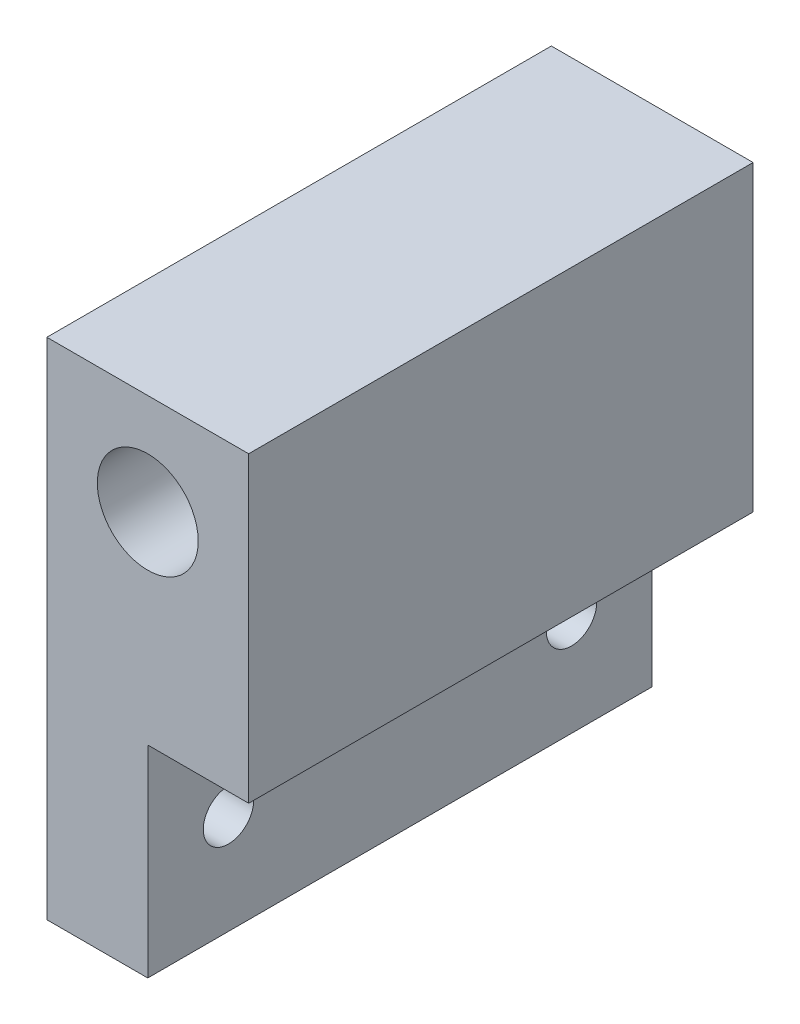
ISO-10303-21;
HEADER;
FILE_DESCRIPTION(('STEP AP214'),'2;1');
FILE_NAME('part.step','',(''),(''),'','','');
FILE_SCHEMA(('AUTOMOTIVE_DESIGN { 1 0 10303 214 1 1 1 1 }'));
ENDSEC;
DATA;
#1=APPLICATION_CONTEXT('core data for automotive mechanical design processes');
#2=APPLICATION_PROTOCOL_DEFINITION('international standard','automotive_design',2000,#1);
#3=PRODUCT_CONTEXT('',#1,'mechanical');
#4=PRODUCT('Part','Part','',(#3));
#5=PRODUCT_RELATED_PRODUCT_CATEGORY('part','',(#4));
#6=PRODUCT_DEFINITION_FORMATION('','',#4);
#7=PRODUCT_DEFINITION_CONTEXT('part definition',#1,'design');
#8=PRODUCT_DEFINITION('design','',#6,#7);
#9=PRODUCT_DEFINITION_SHAPE('','',#8);
#10=(LENGTH_UNIT() NAMED_UNIT(*) SI_UNIT(.MILLI.,.METRE.));
#11=(NAMED_UNIT(*) PLANE_ANGLE_UNIT() SI_UNIT($,.RADIAN.));
#12=(NAMED_UNIT(*) SI_UNIT($,.STERADIAN.) SOLID_ANGLE_UNIT());
#13=UNCERTAINTY_MEASURE_WITH_UNIT(LENGTH_MEASURE(1.E-05),#10,'distance_accuracy_value','');
#14=(GEOMETRIC_REPRESENTATION_CONTEXT(3) GLOBAL_UNCERTAINTY_ASSIGNED_CONTEXT((#13)) GLOBAL_UNIT_ASSIGNED_CONTEXT((#10,
#11,#12)) REPRESENTATION_CONTEXT('',''));
#15=CARTESIAN_POINT('',(0.,0.,0.));
#16=DIRECTION('',(0.,0.,1.));
#17=DIRECTION('',(1.,0.,0.));
#18=AXIS2_PLACEMENT_3D('',#15,#16,#17);
#19=CARTESIAN_POINT('',(9.99999999999999,-57.0281734384888,15.));
#20=DIRECTION('',(1.,0.,0.));
#21=DIRECTION('',(0.,1.,0.));
#22=AXIS2_PLACEMENT_3D('',#19,#20,#21);
#23=PLANE('',#22);
#24=DIRECTION('',(0.,0.,1.));
#25=VECTOR('',#24,1.);
#26=CARTESIAN_POINT('',(10.,-20.,50.));
#27=LINE('',#26,#25);
#28=CARTESIAN_POINT('',(10.,-20.,0.));
#29=VERTEX_POINT('',#28);
#30=CARTESIAN_POINT('',(10.,-20.,50.));
#31=VERTEX_POINT('',#30);
#32=EDGE_CURVE('E97',#29,#31,#27,.T.);
#33=ORIENTED_EDGE('',*,*,#32,.F.);
#34=DIRECTION('',(0.,-1.,0.));
#35=VECTOR('',#34,1.);
#36=CARTESIAN_POINT('',(9.99999999999999,-57.0281734384888,0.));
#37=LINE('',#36,#35);
#38=CARTESIAN_POINT('',(10.,9.99999999999999,0.));
#39=VERTEX_POINT('',#38);
#40=EDGE_CURVE('E123',#39,#29,#37,.T.);
#41=ORIENTED_EDGE('',*,*,#40,.F.);
#42=DIRECTION('',(0.,0.,-1.));
#43=VECTOR('',#42,1.);
#44=CARTESIAN_POINT('',(10.,9.99999999999999,15.));
#45=LINE('',#44,#43);
#46=CARTESIAN_POINT('',(10.,10.,50.));
#47=VERTEX_POINT('',#46);
#48=EDGE_CURVE('E11',#47,#39,#45,.T.);
#49=ORIENTED_EDGE('',*,*,#48,.F.);
#50=DIRECTION('',(0.,1.,0.));
#51=VECTOR('',#50,1.);
#52=CARTESIAN_POINT('',(10.,10.,50.));
#53=LINE('',#52,#51);
#54=EDGE_CURVE('E111',#31,#47,#53,.T.);
#55=ORIENTED_EDGE('',*,*,#54,.F.);
#56=EDGE_LOOP('',(#33,#41,#49,#55));
#57=FACE_BOUND('',#56,.T.);
#58=ADVANCED_FACE('F35',(#57),#23,.T.);
#59=CARTESIAN_POINT('',(0.,9.99999999999999,15.));
#60=DIRECTION('',(0.,1.,0.));
#61=DIRECTION('',(0.,0.,1.));
#62=AXIS2_PLACEMENT_3D('',#59,#60,#61);
#63=PLANE('',#62);
#64=DIRECTION('',(1.,0.,0.));
#65=VECTOR('',#64,1.);
#66=CARTESIAN_POINT('',(0.,9.99999999999999,0.));
#67=LINE('',#66,#65);
#68=CARTESIAN_POINT('',(-10.,9.99999999999999,0.));
#69=VERTEX_POINT('',#68);
#70=EDGE_CURVE('E126',#69,#39,#67,.T.);
#71=ORIENTED_EDGE('',*,*,#70,.F.);
#72=DIRECTION('',(0.,0.,-1.));
#73=VECTOR('',#72,1.);
#74=CARTESIAN_POINT('',(-10.,9.99999999999999,15.));
#75=LINE('',#74,#73);
#76=CARTESIAN_POINT('',(-10.,10.,50.));
#77=VERTEX_POINT('',#76);
#78=EDGE_CURVE('E44',#77,#69,#75,.T.);
#79=ORIENTED_EDGE('',*,*,#78,.F.);
#80=DIRECTION('',(-1.,0.,0.));
#81=VECTOR('',#80,1.);
#82=CARTESIAN_POINT('',(-10.,10.,50.));
#83=LINE('',#82,#81);
#84=EDGE_CURVE('E113',#47,#77,#83,.T.);
#85=ORIENTED_EDGE('',*,*,#84,.F.);
#86=ORIENTED_EDGE('',*,*,#48,.T.);
#87=EDGE_LOOP('',(#71,#79,#85,#86));
#88=FACE_BOUND('',#87,.T.);
#89=ADVANCED_FACE('F168',(#88),#63,.T.);
#90=CARTESIAN_POINT('',(-9.99999999999999,-57.0281734384888,15.));
#91=DIRECTION('',(1.,0.,0.));
#92=DIRECTION('',(0.,1.,0.));
#93=AXIS2_PLACEMENT_3D('',#90,#91,#92);
#94=PLANE('',#93);
#95=CARTESIAN_POINT('',(-10.,-30.,8.));
#96=DIRECTION('',(1.,0.,0.));
#97=DIRECTION('',(0.,1.,0.));
#98=AXIS2_PLACEMENT_3D('',#95,#96,#97);
#99=CIRCLE('',#98,2.5);
#100=CARTESIAN_POINT('',(-10.,-27.5,8.));
#101=VERTEX_POINT('',#100);
#102=EDGE_CURVE('E138',#101,#101,#99,.T.);
#103=ORIENTED_EDGE('',*,*,#102,.T.);
#104=EDGE_LOOP('',(#103));
#105=FACE_BOUND('',#104,.T.);
#106=CARTESIAN_POINT('',(-10.,-30.,42.));
#107=DIRECTION('',(1.,0.,0.));
#108=DIRECTION('',(0.,1.,0.));
#109=AXIS2_PLACEMENT_3D('',#106,#107,#108);
#110=CIRCLE('',#109,2.5);
#111=CARTESIAN_POINT('',(-10.,-27.5,42.));
#112=VERTEX_POINT('',#111);
#113=EDGE_CURVE('E136',#112,#112,#110,.T.);
#114=ORIENTED_EDGE('',*,*,#113,.T.);
#115=EDGE_LOOP('',(#114));
#116=FACE_BOUND('',#115,.T.);
#117=DIRECTION('',(0.,-1.,0.));
#118=VECTOR('',#117,1.);
#119=CARTESIAN_POINT('',(-9.99999999999999,-57.0281734384888,0.));
#120=LINE('',#119,#118);
#121=CARTESIAN_POINT('',(-9.99999999999999,-40.,0.));
#122=VERTEX_POINT('',#121);
#123=EDGE_CURVE('E129',#69,#122,#120,.T.);
#124=ORIENTED_EDGE('',*,*,#123,.T.);
#125=DIRECTION('',(0.,0.,-1.));
#126=VECTOR('',#125,1.);
#127=CARTESIAN_POINT('',(-9.99999999999999,-40.,15.));
#128=LINE('',#127,#126);
#129=CARTESIAN_POINT('',(-9.99999999999999,-40.,50.));
#130=VERTEX_POINT('',#129);
#131=EDGE_CURVE('E133',#130,#122,#128,.T.);
#132=ORIENTED_EDGE('',*,*,#131,.F.);
#133=DIRECTION('',(0.,-1.,0.));
#134=VECTOR('',#133,1.);
#135=CARTESIAN_POINT('',(-10.,10.,50.));
#136=LINE('',#135,#134);
#137=EDGE_CURVE('E110',#77,#130,#136,.T.);
#138=ORIENTED_EDGE('',*,*,#137,.F.);
#139=ORIENTED_EDGE('',*,*,#78,.T.);
#140=EDGE_LOOP('',(#124,#132,#138,#139));
#141=FACE_BOUND('',#140,.T.);
#142=ADVANCED_FACE('F175',(#105,#116,#141),#94,.F.);
#143=CARTESIAN_POINT('',(0.,0.,15.));
#144=DIRECTION('',(0.,0.,-1.));
#145=DIRECTION('',(-1.,0.,0.));
#146=AXIS2_PLACEMENT_3D('',#143,#144,#145);
#147=CYLINDRICAL_SURFACE('',#146,5.);
#148=CARTESIAN_POINT('',(0.,0.,0.));
#149=DIRECTION('',(0.,0.,1.));
#150=DIRECTION('',(1.,0.,0.));
#151=AXIS2_PLACEMENT_3D('',#148,#149,#150);
#152=CIRCLE('',#151,5.);
#153=CARTESIAN_POINT('',(5.,0.,0.));
#154=VERTEX_POINT('',#153);
#155=EDGE_CURVE('E120',#154,#154,#152,.T.);
#156=ORIENTED_EDGE('',*,*,#155,.F.);
#157=EDGE_LOOP('',(#156));
#158=FACE_BOUND('',#157,.T.);
#159=CARTESIAN_POINT('',(0.,0.,50.));
#160=DIRECTION('',(0.,0.,1.));
#161=DIRECTION('',(1.,0.,0.));
#162=AXIS2_PLACEMENT_3D('',#159,#160,#161);
#163=CIRCLE('',#162,5.);
#164=CARTESIAN_POINT('',(5.,0.,50.));
#165=VERTEX_POINT('',#164);
#166=EDGE_CURVE('E115',#165,#165,#163,.T.);
#167=ORIENTED_EDGE('',*,*,#166,.T.);
#168=EDGE_LOOP('',(#167));
#169=FACE_BOUND('',#168,.T.);
#170=ADVANCED_FACE('F37',(#158,#169),#147,.F.);
#171=CARTESIAN_POINT('',(0.,-40.,15.));
#172=DIRECTION('',(0.,1.,0.));
#173=DIRECTION('',(0.,0.,1.));
#174=AXIS2_PLACEMENT_3D('',#171,#172,#173);
#175=PLANE('',#174);
#176=DIRECTION('',(1.,0.,0.));
#177=VECTOR('',#176,1.);
#178=CARTESIAN_POINT('',(0.,-40.,0.));
#179=LINE('',#178,#177);
#180=CARTESIAN_POINT('',(0.,-40.,0.));
#181=VERTEX_POINT('',#180);
#182=EDGE_CURVE('E60',#122,#181,#179,.T.);
#183=ORIENTED_EDGE('',*,*,#182,.T.);
#184=DIRECTION('',(0.,0.,-1.));
#185=VECTOR('',#184,1.);
#186=CARTESIAN_POINT('',(0.,-40.,50.));
#187=LINE('',#186,#185);
#188=CARTESIAN_POINT('',(0.,-40.,50.));
#189=VERTEX_POINT('',#188);
#190=EDGE_CURVE('E93',#189,#181,#187,.T.);
#191=ORIENTED_EDGE('',*,*,#190,.F.);
#192=DIRECTION('',(1.,0.,0.));
#193=VECTOR('',#192,1.);
#194=CARTESIAN_POINT('',(-9.99999999999999,-40.,50.));
#195=LINE('',#194,#193);
#196=EDGE_CURVE('E102',#130,#189,#195,.T.);
#197=ORIENTED_EDGE('',*,*,#196,.F.);
#198=ORIENTED_EDGE('',*,*,#131,.T.);
#199=EDGE_LOOP('',(#183,#191,#197,#198));
#200=FACE_BOUND('',#199,.T.);
#201=ADVANCED_FACE('F101',(#200),#175,.F.);
#202=CARTESIAN_POINT('',(0.,-57.0281734384888,0.));
#203=DIRECTION('',(0.,0.,1.));
#204=DIRECTION('',(1.,0.,0.));
#205=AXIS2_PLACEMENT_3D('',#202,#203,#204);
#206=PLANE('',#205);
#207=ORIENTED_EDGE('',*,*,#155,.T.);
#208=EDGE_LOOP('',(#207));
#209=FACE_BOUND('',#208,.T.);
#210=ORIENTED_EDGE('',*,*,#40,.T.);
#211=DIRECTION('',(1.,0.,0.));
#212=VECTOR('',#211,1.);
#213=CARTESIAN_POINT('',(0.,-20.,0.));
#214=LINE('',#213,#212);
#215=CARTESIAN_POINT('',(0.,-20.,0.));
#216=VERTEX_POINT('',#215);
#217=EDGE_CURVE('E150',#216,#29,#214,.T.);
#218=ORIENTED_EDGE('',*,*,#217,.F.);
#219=DIRECTION('',(0.,1.,0.));
#220=VECTOR('',#219,1.);
#221=CARTESIAN_POINT('',(0.,-40.,0.));
#222=LINE('',#221,#220);
#223=EDGE_CURVE('E104',#181,#216,#222,.T.);
#224=ORIENTED_EDGE('',*,*,#223,.F.);
#225=ORIENTED_EDGE('',*,*,#182,.F.);
#226=ORIENTED_EDGE('',*,*,#123,.F.);
#227=ORIENTED_EDGE('',*,*,#70,.T.);
#228=EDGE_LOOP('',(#210,#218,#224,#225,#226,#227));
#229=FACE_BOUND('',#228,.T.);
#230=ADVANCED_FACE('F157',(#209,#229),#206,.F.);
#231=CARTESIAN_POINT('',(-9.99999999999999,-40.,50.));
#232=DIRECTION('',(0.,0.,1.));
#233=DIRECTION('',(1.,0.,0.));
#234=AXIS2_PLACEMENT_3D('',#231,#232,#233);
#235=PLANE('',#234);
#236=DIRECTION('',(1.,0.,0.));
#237=VECTOR('',#236,1.);
#238=CARTESIAN_POINT('',(0.,-20.,50.));
#239=LINE('',#238,#237);
#240=CARTESIAN_POINT('',(0.,-20.,50.));
#241=VERTEX_POINT('',#240);
#242=EDGE_CURVE('E148',#241,#31,#239,.T.);
#243=ORIENTED_EDGE('',*,*,#242,.T.);
#244=ORIENTED_EDGE('',*,*,#54,.T.);
#245=ORIENTED_EDGE('',*,*,#84,.T.);
#246=ORIENTED_EDGE('',*,*,#137,.T.);
#247=ORIENTED_EDGE('',*,*,#196,.T.);
#248=DIRECTION('',(0.,-1.,0.));
#249=VECTOR('',#248,1.);
#250=CARTESIAN_POINT('',(0.,-40.,50.));
#251=LINE('',#250,#249);
#252=EDGE_CURVE('E89',#241,#189,#251,.T.);
#253=ORIENTED_EDGE('',*,*,#252,.F.);
#254=EDGE_LOOP('',(#243,#244,#245,#246,#247,#253));
#255=FACE_BOUND('',#254,.T.);
#256=ORIENTED_EDGE('',*,*,#166,.F.);
#257=EDGE_LOOP('',(#256));
#258=FACE_BOUND('',#257,.T.);
#259=ADVANCED_FACE('F106',(#255,#258),#235,.T.);
#260=CARTESIAN_POINT('',(-20.,-30.,42.));
#261=DIRECTION('',(1.,0.,0.));
#262=DIRECTION('',(0.,1.,0.));
#263=AXIS2_PLACEMENT_3D('',#260,#261,#262);
#264=CYLINDRICAL_SURFACE('',#263,2.5);
#265=CARTESIAN_POINT('',(0.,-30.,42.));
#266=DIRECTION('',(-1.,0.,0.));
#267=DIRECTION('',(0.,-1.,0.));
#268=AXIS2_PLACEMENT_3D('',#265,#266,#267);
#269=CIRCLE('',#268,2.5);
#270=CARTESIAN_POINT('',(0.,-32.5,42.));
#271=VERTEX_POINT('',#270);
#272=EDGE_CURVE('E140',#271,#271,#269,.F.);
#273=ORIENTED_EDGE('',*,*,#272,.T.);
#274=EDGE_LOOP('',(#273));
#275=FACE_BOUND('',#274,.T.);
#276=ORIENTED_EDGE('',*,*,#113,.F.);
#277=EDGE_LOOP('',(#276));
#278=FACE_BOUND('',#277,.T.);
#279=ADVANCED_FACE('F156',(#275,#278),#264,.F.);
#280=CARTESIAN_POINT('',(-20.,-30.,8.));
#281=DIRECTION('',(1.,0.,0.));
#282=DIRECTION('',(0.,1.,0.));
#283=AXIS2_PLACEMENT_3D('',#280,#281,#282);
#284=CYLINDRICAL_SURFACE('',#283,2.5);
#285=CARTESIAN_POINT('',(0.,-30.,8.));
#286=DIRECTION('',(-1.,0.,0.));
#287=DIRECTION('',(0.,-1.,0.));
#288=AXIS2_PLACEMENT_3D('',#285,#286,#287);
#289=CIRCLE('',#288,2.5);
#290=CARTESIAN_POINT('',(0.,-32.5,8.));
#291=VERTEX_POINT('',#290);
#292=EDGE_CURVE('E39',#291,#291,#289,.F.);
#293=ORIENTED_EDGE('',*,*,#292,.T.);
#294=EDGE_LOOP('',(#293));
#295=FACE_BOUND('',#294,.T.);
#296=ORIENTED_EDGE('',*,*,#102,.F.);
#297=EDGE_LOOP('',(#296));
#298=FACE_BOUND('',#297,.T.);
#299=ADVANCED_FACE('F163',(#295,#298),#284,.F.);
#300=CARTESIAN_POINT('',(0.,-20.,50.));
#301=DIRECTION('',(-1.,0.,0.));
#302=DIRECTION('',(0.,-1.,0.));
#303=AXIS2_PLACEMENT_3D('',#300,#301,#302);
#304=PLANE('',#303);
#305=ORIENTED_EDGE('',*,*,#292,.F.);
#306=EDGE_LOOP('',(#305));
#307=FACE_BOUND('',#306,.T.);
#308=ORIENTED_EDGE('',*,*,#252,.T.);
#309=ORIENTED_EDGE('',*,*,#190,.T.);
#310=ORIENTED_EDGE('',*,*,#223,.T.);
#311=DIRECTION('',(0.,0.,1.));
#312=VECTOR('',#311,1.);
#313=CARTESIAN_POINT('',(0.,-20.,50.));
#314=LINE('',#313,#312);
#315=EDGE_CURVE('E52',#216,#241,#314,.T.);
#316=ORIENTED_EDGE('',*,*,#315,.T.);
#317=EDGE_LOOP('',(#308,#309,#310,#316));
#318=FACE_BOUND('',#317,.T.);
#319=ORIENTED_EDGE('',*,*,#272,.F.);
#320=EDGE_LOOP('',(#319));
#321=FACE_BOUND('',#320,.T.);
#322=ADVANCED_FACE('F91',(#307,#318,#321),#304,.F.);
#323=CARTESIAN_POINT('',(0.,-20.,50.));
#324=DIRECTION('',(0.,1.,0.));
#325=DIRECTION('',(-1.,0.,0.));
#326=AXIS2_PLACEMENT_3D('',#323,#324,#325);
#327=PLANE('',#326);
#328=ORIENTED_EDGE('',*,*,#32,.T.);
#329=ORIENTED_EDGE('',*,*,#242,.F.);
#330=ORIENTED_EDGE('',*,*,#315,.F.);
#331=ORIENTED_EDGE('',*,*,#217,.T.);
#332=EDGE_LOOP('',(#328,#329,#330,#331));
#333=FACE_BOUND('',#332,.T.);
#334=ADVANCED_FACE('F199',(#333),#327,.F.);
#335=CLOSED_SHELL('',(#58,#89,#142,#170,#201,#230,#259,#279,#299,#322,#334));
#336=MANIFOLD_SOLID_BREP('B2',#335);
#337=ADVANCED_BREP_SHAPE_REPRESENTATION('',(#18,#336),#14);
#338=SHAPE_DEFINITION_REPRESENTATION(#9,#337);
ENDSEC;
END-ISO-10303-21;
